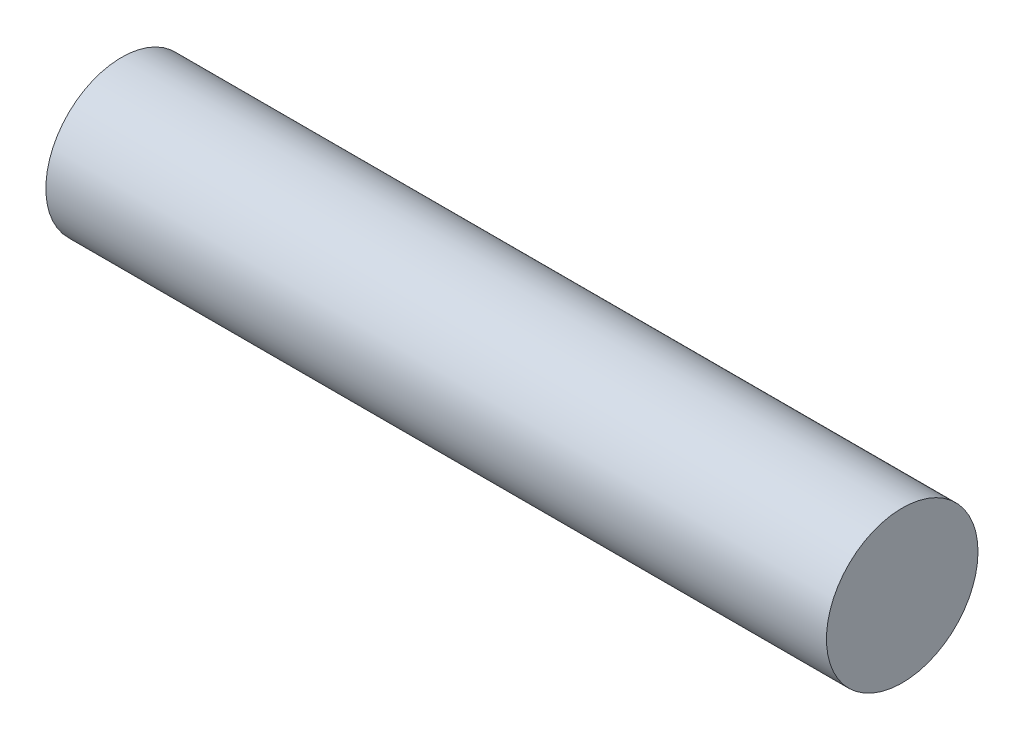
ISO-10303-21;
HEADER;
FILE_DESCRIPTION(('STEP AP214'),'2;1');
FILE_NAME('part.step','',(''),(''),'','','');
FILE_SCHEMA(('AUTOMOTIVE_DESIGN { 1 0 10303 214 1 1 1 1 }'));
ENDSEC;
DATA;
#1=APPLICATION_CONTEXT('core data for automotive mechanical design processes');
#2=APPLICATION_PROTOCOL_DEFINITION('international standard','automotive_design',2000,#1);
#3=PRODUCT_CONTEXT('',#1,'mechanical');
#4=PRODUCT('Part','Part','',(#3));
#5=PRODUCT_RELATED_PRODUCT_CATEGORY('part','',(#4));
#6=PRODUCT_DEFINITION_FORMATION('','',#4);
#7=PRODUCT_DEFINITION_CONTEXT('part definition',#1,'design');
#8=PRODUCT_DEFINITION('design','',#6,#7);
#9=PRODUCT_DEFINITION_SHAPE('','',#8);
#10=(LENGTH_UNIT() NAMED_UNIT(*) SI_UNIT(.MILLI.,.METRE.));
#11=(NAMED_UNIT(*) PLANE_ANGLE_UNIT() SI_UNIT($,.RADIAN.));
#12=(NAMED_UNIT(*) SI_UNIT($,.STERADIAN.) SOLID_ANGLE_UNIT());
#13=UNCERTAINTY_MEASURE_WITH_UNIT(LENGTH_MEASURE(1.E-05),#10,'distance_accuracy_value','');
#14=(GEOMETRIC_REPRESENTATION_CONTEXT(3) GLOBAL_UNCERTAINTY_ASSIGNED_CONTEXT((#13)) GLOBAL_UNIT_ASSIGNED_CONTEXT((#10,
#11,#12)) REPRESENTATION_CONTEXT('',''));
#15=CARTESIAN_POINT('',(0.,0.,0.));
#16=DIRECTION('',(0.,0.,1.));
#17=DIRECTION('',(1.,0.,0.));
#18=AXIS2_PLACEMENT_3D('',#15,#16,#17);
#19=CARTESIAN_POINT('',(385.503722019852,0.,0.));
#20=DIRECTION('',(1.,0.,0.));
#21=DIRECTION('',(0.,0.,-1.));
#22=AXIS2_PLACEMENT_3D('',#19,#20,#21);
#23=PLANE('',#22);
#24=CARTESIAN_POINT('',(385.503722019852,19.05,0.));
#25=DIRECTION('',(-1.,0.,0.));
#26=DIRECTION('',(0.,0.,1.));
#27=AXIS2_PLACEMENT_3D('',#24,#25,#26);
#28=CIRCLE('',#27,25.273);
#29=CARTESIAN_POINT('',(385.503722019852,19.05,-25.273));
#30=VERTEX_POINT('',#29);
#31=EDGE_CURVE('E11',#30,#30,#28,.T.);
#32=ORIENTED_EDGE('',*,*,#31,.F.);
#33=EDGE_LOOP('',(#32));
#34=FACE_BOUND('',#33,.T.);
#35=ADVANCED_FACE('F99',(#34),#23,.T.);
#36=CARTESIAN_POINT('',(125.153722019852,19.05,0.));
#37=DIRECTION('',(1.,0.,0.));
#38=DIRECTION('',(0.,0.,-1.));
#39=AXIS2_PLACEMENT_3D('',#36,#37,#38);
#40=CYLINDRICAL_SURFACE('',#39,25.273);
#41=CARTESIAN_POINT('',(125.153722019852,19.05,0.));
#42=DIRECTION('',(-1.,0.,0.));
#43=DIRECTION('',(0.,0.,1.));
#44=AXIS2_PLACEMENT_3D('',#41,#42,#43);
#45=CIRCLE('',#44,25.273);
#46=CARTESIAN_POINT('',(125.153722019852,19.05,-25.273));
#47=VERTEX_POINT('',#46);
#48=EDGE_CURVE('E107',#47,#47,#45,.T.);
#49=CARTESIAN_POINT('',(125.153722019852,19.05,-25.273));
#50=CARTESIAN_POINT('',(127.865701186518,19.05,-25.273));
#51=CARTESIAN_POINT('',(130.577680353185,19.05,-25.273));
#52=CARTESIAN_POINT('',(136.001638686518,19.05,-25.273));
#53=CARTESIAN_POINT('',(138.713617853185,19.05,-25.273));
#54=CARTESIAN_POINT('',(144.137576186518,19.05,-25.273));
#55=CARTESIAN_POINT('',(146.849555353185,19.05,-25.273));
#56=CARTESIAN_POINT('',(152.273513686518,19.05,-25.273));
#57=CARTESIAN_POINT('',(154.985492853185,19.05,-25.273));
#58=CARTESIAN_POINT('',(160.409451186518,19.05,-25.273));
#59=CARTESIAN_POINT('',(163.121430353185,19.05,-25.273));
#60=CARTESIAN_POINT('',(168.545388686518,19.05,-25.273));
#61=CARTESIAN_POINT('',(171.257367853185,19.05,-25.273));
#62=CARTESIAN_POINT('',(176.681326186518,19.05,-25.273));
#63=CARTESIAN_POINT('',(179.393305353185,19.05,-25.273));
#64=CARTESIAN_POINT('',(184.817263686518,19.05,-25.273));
#65=CARTESIAN_POINT('',(187.529242853185,19.05,-25.273));
#66=CARTESIAN_POINT('',(192.953201186518,19.05,-25.273));
#67=CARTESIAN_POINT('',(195.665180353185,19.05,-25.273));
#68=CARTESIAN_POINT('',(201.089138686518,19.05,-25.273));
#69=CARTESIAN_POINT('',(203.801117853185,19.05,-25.273));
#70=CARTESIAN_POINT('',(209.225076186518,19.05,-25.273));
#71=CARTESIAN_POINT('',(211.937055353185,19.05,-25.273));
#72=CARTESIAN_POINT('',(217.361013686518,19.05,-25.273));
#73=CARTESIAN_POINT('',(220.072992853185,19.05,-25.273));
#74=CARTESIAN_POINT('',(225.496951186518,19.05,-25.273));
#75=CARTESIAN_POINT('',(228.208930353185,19.05,-25.273));
#76=CARTESIAN_POINT('',(233.632888686518,19.05,-25.273));
#77=CARTESIAN_POINT('',(236.344867853185,19.05,-25.273));
#78=CARTESIAN_POINT('',(241.768826186518,19.05,-25.273));
#79=CARTESIAN_POINT('',(244.480805353185,19.05,-25.273));
#80=CARTESIAN_POINT('',(249.904763686518,19.05,-25.273));
#81=CARTESIAN_POINT('',(252.616742853185,19.05,-25.273));
#82=CARTESIAN_POINT('',(258.040701186518,19.05,-25.273));
#83=CARTESIAN_POINT('',(260.752680353185,19.05,-25.273));
#84=CARTESIAN_POINT('',(266.176638686518,19.05,-25.273));
#85=CARTESIAN_POINT('',(268.888617853185,19.05,-25.273));
#86=CARTESIAN_POINT('',(274.312576186518,19.05,-25.273));
#87=CARTESIAN_POINT('',(277.024555353185,19.05,-25.273));
#88=CARTESIAN_POINT('',(282.448513686518,19.05,-25.273));
#89=CARTESIAN_POINT('',(285.160492853185,19.05,-25.273));
#90=CARTESIAN_POINT('',(290.584451186518,19.05,-25.273));
#91=CARTESIAN_POINT('',(293.296430353185,19.05,-25.273));
#92=CARTESIAN_POINT('',(298.720388686519,19.05,-25.273));
#93=CARTESIAN_POINT('',(301.432367853185,19.05,-25.273));
#94=CARTESIAN_POINT('',(306.856326186518,19.05,-25.273));
#95=CARTESIAN_POINT('',(309.568305353185,19.05,-25.273));
#96=CARTESIAN_POINT('',(314.992263686519,19.05,-25.273));
#97=CARTESIAN_POINT('',(317.704242853185,19.05,-25.273));
#98=CARTESIAN_POINT('',(323.128201186519,19.05,-25.273));
#99=CARTESIAN_POINT('',(325.840180353185,19.05,-25.273));
#100=CARTESIAN_POINT('',(331.264138686518,19.05,-25.273));
#101=CARTESIAN_POINT('',(333.976117853185,19.05,-25.273));
#102=CARTESIAN_POINT('',(339.400076186519,19.05,-25.273));
#103=CARTESIAN_POINT('',(342.112055353185,19.05,-25.273));
#104=CARTESIAN_POINT('',(347.536013686519,19.05,-25.273));
#105=CARTESIAN_POINT('',(350.247992853185,19.05,-25.273));
#106=CARTESIAN_POINT('',(355.671951186519,19.05,-25.273));
#107=CARTESIAN_POINT('',(358.383930353185,19.05,-25.273));
#108=CARTESIAN_POINT('',(363.807888686519,19.05,-25.273));
#109=CARTESIAN_POINT('',(366.519867853185,19.05,-25.273));
#110=CARTESIAN_POINT('',(371.943826186518,19.05,-25.273));
#111=CARTESIAN_POINT('',(374.655805353185,19.05,-25.273));
#112=CARTESIAN_POINT('',(380.079763686518,19.05,-25.273));
#113=CARTESIAN_POINT('',(382.791742853185,19.05,-25.273));
#114=CARTESIAN_POINT('',(385.503722019852,19.05,-25.273));
#115=B_SPLINE_CURVE_WITH_KNOTS('',3,(#49,#50,#51,#52,#53,#54,#55,#56,#57,#58,#59,#60,#61,#62,
#63,#64,#65,#66,#67,#68,#69,#70,#71,#72,#73,#74,#75,#76,#77,#78,#79,#80,#81,#82,#83,#84,#85,#86,
#87,#88,#89,#90,#91,#92,#93,#94,#95,#96,#97,#98,#99,#100,#101,#102,#103,#104,#105,#106,#107,
#108,#109,#110,#111,#112,#113,#114),.UNSPECIFIED.,.F.,.F.,(4,2,2,2,2,2,2,2,2,2,2,2,2,2,2,2,2,2,
2,2,2,2,2,2,2,2,2,2,2,2,2,2,4),(0.,8.1359375,16.271875,24.4078125,32.54375,40.6796875,48.815625,
56.9515625,65.0875,73.2234375,81.359375,89.4953125,97.63125,105.7671875,113.903125,122.0390625,
130.175,138.3109375,146.446875,154.5828125,162.71875,170.8546875,178.990625,187.1265625,
195.2625,203.3984375,211.534375,219.6703125,227.80625,235.9421875,244.078125,252.2140625,
260.35),.UNSPECIFIED.);
#116=EDGE_CURVE('BSEAM115',#47,#30,#115,.T.);
#117=ORIENTED_EDGE('',*,*,#48,.F.);
#118=ORIENTED_EDGE('',*,*,#31,.T.);
#119=ORIENTED_EDGE('',*,*,#116,.T.);
#120=ORIENTED_EDGE('',*,*,#116,.F.);
#121=EDGE_LOOP('',(#117,#119,#118,#120));
#122=FACE_BOUND('',#121,.T.);
#123=ADVANCED_FACE('F115',(#122),#40,.T.);
#124=CARTESIAN_POINT('',(125.153722019852,38.1,0.));
#125=DIRECTION('',(1.,0.,0.));
#126=DIRECTION('',(0.,0.,-1.));
#127=AXIS2_PLACEMENT_3D('',#124,#125,#126);
#128=PLANE('',#127);
#129=ORIENTED_EDGE('',*,*,#48,.T.);
#130=EDGE_LOOP('',(#129));
#131=FACE_BOUND('',#130,.T.);
#132=ADVANCED_FACE('F101',(#131),#128,.F.);
#133=CLOSED_SHELL('',(#35,#123,#132));
#134=MANIFOLD_SOLID_BREP('B2',#133);
#135=ADVANCED_BREP_SHAPE_REPRESENTATION('',(#18,#134),#14);
#136=SHAPE_DEFINITION_REPRESENTATION(#9,#135);
ENDSEC;
END-ISO-10303-21;
